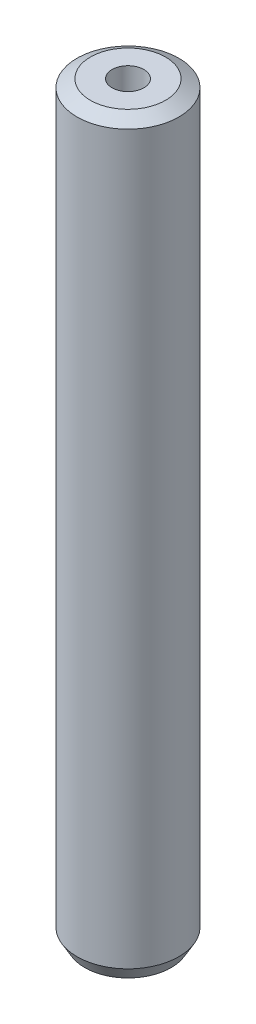
ISO-10303-21;
HEADER;
FILE_DESCRIPTION(('STEP AP214'),'2;1');
FILE_NAME('part.step','',(''),(''),'','','');
FILE_SCHEMA(('AUTOMOTIVE_DESIGN { 1 0 10303 214 1 1 1 1 }'));
ENDSEC;
DATA;
#1=APPLICATION_CONTEXT('core data for automotive mechanical design processes');
#2=APPLICATION_PROTOCOL_DEFINITION('international standard','automotive_design',2000,#1);
#3=PRODUCT_CONTEXT('',#1,'mechanical');
#4=PRODUCT('Part','Part','',(#3));
#5=PRODUCT_RELATED_PRODUCT_CATEGORY('part','',(#4));
#6=PRODUCT_DEFINITION_FORMATION('','',#4);
#7=PRODUCT_DEFINITION_CONTEXT('part definition',#1,'design');
#8=PRODUCT_DEFINITION('design','',#6,#7);
#9=PRODUCT_DEFINITION_SHAPE('','',#8);
#10=(LENGTH_UNIT() NAMED_UNIT(*) SI_UNIT(.MILLI.,.METRE.));
#11=(NAMED_UNIT(*) PLANE_ANGLE_UNIT() SI_UNIT($,.RADIAN.));
#12=(NAMED_UNIT(*) SI_UNIT($,.STERADIAN.) SOLID_ANGLE_UNIT());
#13=UNCERTAINTY_MEASURE_WITH_UNIT(LENGTH_MEASURE(1.E-05),#10,'distance_accuracy_value','');
#14=(GEOMETRIC_REPRESENTATION_CONTEXT(3) GLOBAL_UNCERTAINTY_ASSIGNED_CONTEXT((#13)) GLOBAL_UNIT_ASSIGNED_CONTEXT((#10,
#11,#12)) REPRESENTATION_CONTEXT('',''));
#15=CARTESIAN_POINT('',(0.,0.,0.));
#16=DIRECTION('',(0.,0.,1.));
#17=DIRECTION('',(1.,0.,0.));
#18=AXIS2_PLACEMENT_3D('',#15,#16,#17);
#19=CARTESIAN_POINT('',(0.,293.747996278976,0.));
#20=DIRECTION('',(0.,-1.,0.));
#21=DIRECTION('',(0.,0.,-1.));
#22=AXIS2_PLACEMENT_3D('',#19,#20,#21);
#23=CYLINDRICAL_SURFACE('',#22,20.);
#24=CARTESIAN_POINT('',(0.,290.712039357806,0.));
#25=DIRECTION('',(0.,1.,0.));
#26=DIRECTION('',(0.,0.,1.));
#27=AXIS2_PLACEMENT_3D('',#24,#25,#26);
#28=CIRCLE('',#27,20.);
#29=CARTESIAN_POINT('',(0.,290.712039357806,20.));
#30=VERTEX_POINT('',#29);
#31=EDGE_CURVE('E50',#30,#30,#28,.F.);
#32=ORIENTED_EDGE('',*,*,#31,.T.);
#33=EDGE_LOOP('',(#32));
#34=FACE_BOUND('',#33,.T.);
#35=CARTESIAN_POINT('',(0.,5.25843163705592,0.));
#36=DIRECTION('',(0.,1.,0.));
#37=DIRECTION('',(0.,0.,1.));
#38=AXIS2_PLACEMENT_3D('',#35,#36,#37);
#39=CIRCLE('',#38,20.);
#40=CARTESIAN_POINT('',(0.,5.25843163705592,20.));
#41=VERTEX_POINT('',#40);
#42=EDGE_CURVE('E51',#41,#41,#39,.T.);
#43=ORIENTED_EDGE('',*,*,#42,.T.);
#44=EDGE_LOOP('',(#43));
#45=FACE_BOUND('',#44,.T.);
#46=ADVANCED_FACE('F39',(#34,#45),#23,.T.);
#47=CARTESIAN_POINT('',(0.,293.747996278976,0.));
#48=DIRECTION('',(0.,1.,0.));
#49=DIRECTION('',(0.,0.,1.));
#50=AXIS2_PLACEMENT_3D('',#47,#48,#49);
#51=PLANE('',#50);
#52=CARTESIAN_POINT('',(0.,293.747996278976,0.));
#53=DIRECTION('',(0.,1.,0.));
#54=DIRECTION('',(0.,0.,1.));
#55=AXIS2_PLACEMENT_3D('',#52,#53,#54);
#56=CIRCLE('',#55,14.741568362944);
#57=CARTESIAN_POINT('',(0.,293.747996278976,14.741568362944));
#58=VERTEX_POINT('',#57);
#59=EDGE_CURVE('E54',#58,#58,#56,.T.);
#60=ORIENTED_EDGE('',*,*,#59,.T.);
#61=EDGE_LOOP('',(#60));
#62=FACE_BOUND('',#61,.T.);
#63=CARTESIAN_POINT('',(0.,293.747996278976,0.));
#64=DIRECTION('',(0.,1.,0.));
#65=DIRECTION('',(0.,0.,1.));
#66=AXIS2_PLACEMENT_3D('',#63,#64,#65);
#67=CIRCLE('',#66,6.24033410404187);
#68=CARTESIAN_POINT('',(0.,293.747996278976,6.24033410404187));
#69=VERTEX_POINT('',#68);
#70=EDGE_CURVE('E58',#69,#69,#67,.T.);
#71=ORIENTED_EDGE('',*,*,#70,.F.);
#72=EDGE_LOOP('',(#71));
#73=FACE_BOUND('',#72,.T.);
#74=ADVANCED_FACE('F69',(#62,#73),#51,.T.);
#75=CARTESIAN_POINT('',(0.,0.,0.));
#76=DIRECTION('',(0.,1.,0.));
#77=DIRECTION('',(0.,0.,1.));
#78=AXIS2_PLACEMENT_3D('',#75,#76,#77);
#79=PLANE('',#78);
#80=CARTESIAN_POINT('',(0.,0.,0.));
#81=DIRECTION('',(0.,1.,0.));
#82=DIRECTION('',(0.,0.,1.));
#83=AXIS2_PLACEMENT_3D('',#80,#81,#82);
#84=CIRCLE('',#83,16.9640430788305);
#85=CARTESIAN_POINT('',(0.,0.,16.9640430788305));
#86=VERTEX_POINT('',#85);
#87=EDGE_CURVE('E10',#86,#86,#84,.F.);
#88=ORIENTED_EDGE('',*,*,#87,.T.);
#89=EDGE_LOOP('',(#88));
#90=FACE_BOUND('',#89,.T.);
#91=CARTESIAN_POINT('',(0.,0.,0.));
#92=DIRECTION('',(0.,1.,0.));
#93=DIRECTION('',(0.,0.,1.));
#94=AXIS2_PLACEMENT_3D('',#91,#92,#93);
#95=CIRCLE('',#94,6.24033410404187);
#96=CARTESIAN_POINT('',(0.,0.,6.24033410404187));
#97=VERTEX_POINT('',#96);
#98=EDGE_CURVE('E63',#97,#97,#95,.T.);
#99=ORIENTED_EDGE('',*,*,#98,.T.);
#100=EDGE_LOOP('',(#99));
#101=FACE_BOUND('',#100,.T.);
#102=ADVANCED_FACE('F75',(#90,#101),#79,.F.);
#103=CARTESIAN_POINT('',(0.,293.747996278976,0.));
#104=DIRECTION('',(0.,-1.,0.));
#105=DIRECTION('',(0.,0.,-1.));
#106=AXIS2_PLACEMENT_3D('',#103,#104,#105);
#107=CYLINDRICAL_SURFACE('',#106,6.24033410404187);
#108=ORIENTED_EDGE('',*,*,#70,.T.);
#109=EDGE_LOOP('',(#108));
#110=FACE_BOUND('',#109,.T.);
#111=ORIENTED_EDGE('',*,*,#98,.F.);
#112=EDGE_LOOP('',(#111));
#113=FACE_BOUND('',#112,.T.);
#114=ADVANCED_FACE('F70',(#110,#113),#107,.F.);
#115=CARTESIAN_POINT('',(0.,293.747996278976,0.));
#116=DIRECTION('',(0.,-1.,0.));
#117=DIRECTION('',(0.,0.,-1.));
#118=AXIS2_PLACEMENT_3D('',#115,#116,#117);
#119=CONICAL_SURFACE('',#118,14.741568362944,1.04719755119659);
#120=ORIENTED_EDGE('',*,*,#31,.F.);
#121=EDGE_LOOP('',(#120));
#122=FACE_BOUND('',#121,.T.);
#123=ORIENTED_EDGE('',*,*,#59,.F.);
#124=EDGE_LOOP('',(#123));
#125=FACE_BOUND('',#124,.T.);
#126=ADVANCED_FACE('F81',(#122,#125),#119,.T.);
#127=CARTESIAN_POINT('',(0.,5.25843163705592,0.));
#128=DIRECTION('',(0.,1.,0.));
#129=DIRECTION('',(0.,0.,1.));
#130=AXIS2_PLACEMENT_3D('',#127,#128,#129);
#131=CONICAL_SURFACE('',#130,20.,0.523598775598305);
#132=ORIENTED_EDGE('',*,*,#87,.F.);
#133=EDGE_LOOP('',(#132));
#134=FACE_BOUND('',#133,.T.);
#135=ORIENTED_EDGE('',*,*,#42,.F.);
#136=EDGE_LOOP('',(#135));
#137=FACE_BOUND('',#136,.T.);
#138=ADVANCED_FACE('F45',(#134,#137),#131,.T.);
#139=CLOSED_SHELL('',(#46,#74,#102,#114,#126,#138));
#140=MANIFOLD_SOLID_BREP('B2',#139);
#141=ADVANCED_BREP_SHAPE_REPRESENTATION('',(#18,#140),#14);
#142=SHAPE_DEFINITION_REPRESENTATION(#9,#141);
ENDSEC;
END-ISO-10303-21;
